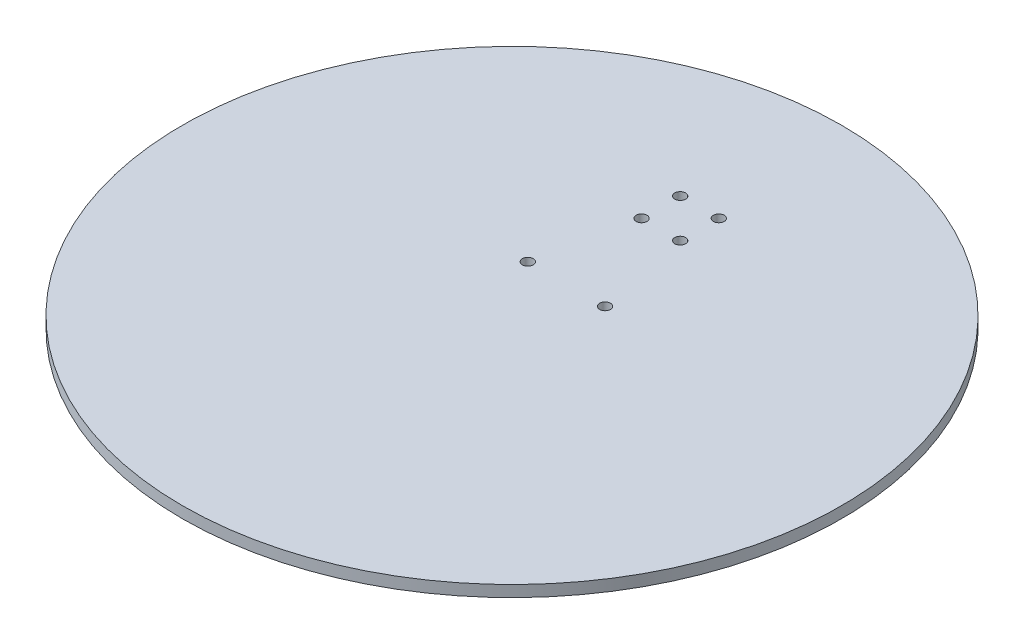
ISO-10303-21;
HEADER;
FILE_DESCRIPTION(('STEP AP214'),'2;1');
FILE_NAME('part.step','',(''),(''),'','','');
FILE_SCHEMA(('AUTOMOTIVE_DESIGN { 1 0 10303 214 1 1 1 1 }'));
ENDSEC;
DATA;
#1=APPLICATION_CONTEXT('core data for automotive mechanical design processes');
#2=APPLICATION_PROTOCOL_DEFINITION('international standard','automotive_design',2000,#1);
#3=PRODUCT_CONTEXT('',#1,'mechanical');
#4=PRODUCT('Part','Part','',(#3));
#5=PRODUCT_RELATED_PRODUCT_CATEGORY('part','',(#4));
#6=PRODUCT_DEFINITION_FORMATION('','',#4);
#7=PRODUCT_DEFINITION_CONTEXT('part definition',#1,'design');
#8=PRODUCT_DEFINITION('design','',#6,#7);
#9=PRODUCT_DEFINITION_SHAPE('','',#8);
#10=(LENGTH_UNIT() NAMED_UNIT(*) SI_UNIT(.MILLI.,.METRE.));
#11=(NAMED_UNIT(*) PLANE_ANGLE_UNIT() SI_UNIT($,.RADIAN.));
#12=(NAMED_UNIT(*) SI_UNIT($,.STERADIAN.) SOLID_ANGLE_UNIT());
#13=UNCERTAINTY_MEASURE_WITH_UNIT(LENGTH_MEASURE(1.E-05),#10,'distance_accuracy_value','');
#14=(GEOMETRIC_REPRESENTATION_CONTEXT(3) GLOBAL_UNCERTAINTY_ASSIGNED_CONTEXT((#13)) GLOBAL_UNIT_ASSIGNED_CONTEXT((#10,
#11,#12)) REPRESENTATION_CONTEXT('',''));
#15=CARTESIAN_POINT('',(0.,0.,0.));
#16=DIRECTION('',(0.,0.,1.));
#17=DIRECTION('',(1.,0.,0.));
#18=AXIS2_PLACEMENT_3D('',#15,#16,#17);
#19=CARTESIAN_POINT('',(0.,4.7,0.));
#20=DIRECTION('',(0.,1.,0.));
#21=DIRECTION('',(0.,0.,1.));
#22=AXIS2_PLACEMENT_3D('',#19,#20,#21);
#23=PLANE('',#22);
#24=CARTESIAN_POINT('',(-16.,4.7,-22.54));
#25=DIRECTION('',(0.,1.,0.));
#26=DIRECTION('',(0.,0.,1.));
#27=AXIS2_PLACEMENT_3D('',#24,#25,#26);
#28=CIRCLE('',#27,2.25);
#29=CARTESIAN_POINT('',(-16.,4.7,-20.29));
#30=VERTEX_POINT('',#29);
#31=EDGE_CURVE('E86',#30,#30,#28,.T.);
#32=ORIENTED_EDGE('',*,*,#31,.F.);
#33=EDGE_LOOP('',(#32));
#34=FACE_BOUND('',#33,.T.);
#35=CARTESIAN_POINT('',(7.99999999999999,4.7,-61.66));
#36=DIRECTION('',(0.,1.,0.));
#37=DIRECTION('',(0.,0.,1.));
#38=AXIS2_PLACEMENT_3D('',#35,#36,#37);
#39=CIRCLE('',#38,2.25);
#40=CARTESIAN_POINT('',(7.99999999999999,4.7,-59.41));
#41=VERTEX_POINT('',#40);
#42=EDGE_CURVE('E70',#41,#41,#39,.T.);
#43=ORIENTED_EDGE('',*,*,#42,.F.);
#44=EDGE_LOOP('',(#43));
#45=FACE_BOUND('',#44,.T.);
#46=CARTESIAN_POINT('',(-8.00000000000002,4.7,-77.66));
#47=DIRECTION('',(0.,1.,0.));
#48=DIRECTION('',(0.,0.,1.));
#49=AXIS2_PLACEMENT_3D('',#46,#47,#48);
#50=CIRCLE('',#49,2.25);
#51=CARTESIAN_POINT('',(-8.00000000000002,4.7,-75.41));
#52=VERTEX_POINT('',#51);
#53=EDGE_CURVE('E56',#52,#52,#50,.T.);
#54=ORIENTED_EDGE('',*,*,#53,.F.);
#55=EDGE_LOOP('',(#54));
#56=FACE_BOUND('',#55,.T.);
#57=CARTESIAN_POINT('',(0.,4.7,0.));
#58=DIRECTION('',(0.,1.,0.));
#59=DIRECTION('',(0.,0.,1.));
#60=AXIS2_PLACEMENT_3D('',#57,#58,#59);
#61=CIRCLE('',#60,136.5);
#62=CARTESIAN_POINT('',(0.,4.7,136.5));
#63=VERTEX_POINT('',#62);
#64=EDGE_CURVE('E10',#63,#63,#61,.T.);
#65=ORIENTED_EDGE('',*,*,#64,.T.);
#66=EDGE_LOOP('',(#65));
#67=FACE_BOUND('',#66,.T.);
#68=CARTESIAN_POINT('',(7.99999999999998,4.7,-77.66));
#69=DIRECTION('',(0.,1.,0.));
#70=DIRECTION('',(0.,0.,1.));
#71=AXIS2_PLACEMENT_3D('',#68,#69,#70);
#72=CIRCLE('',#71,2.25);
#73=CARTESIAN_POINT('',(7.99999999999998,4.7,-75.41));
#74=VERTEX_POINT('',#73);
#75=EDGE_CURVE('E62',#74,#74,#72,.T.);
#76=ORIENTED_EDGE('',*,*,#75,.F.);
#77=EDGE_LOOP('',(#76));
#78=FACE_BOUND('',#77,.T.);
#79=CARTESIAN_POINT('',(-8.00000000000002,4.7,-61.66));
#80=DIRECTION('',(0.,1.,0.));
#81=DIRECTION('',(0.,0.,1.));
#82=AXIS2_PLACEMENT_3D('',#79,#80,#81);
#83=CIRCLE('',#82,2.25);
#84=CARTESIAN_POINT('',(-8.00000000000002,4.7,-59.41));
#85=VERTEX_POINT('',#84);
#86=EDGE_CURVE('E78',#85,#85,#83,.T.);
#87=ORIENTED_EDGE('',*,*,#86,.F.);
#88=EDGE_LOOP('',(#87));
#89=FACE_BOUND('',#88,.T.);
#90=CARTESIAN_POINT('',(16.,4.7,-22.54));
#91=DIRECTION('',(0.,1.,0.));
#92=DIRECTION('',(0.,0.,1.));
#93=AXIS2_PLACEMENT_3D('',#90,#91,#92);
#94=CIRCLE('',#93,2.25);
#95=CARTESIAN_POINT('',(16.,4.7,-20.29));
#96=VERTEX_POINT('',#95);
#97=EDGE_CURVE('E94',#96,#96,#94,.T.);
#98=ORIENTED_EDGE('',*,*,#97,.F.);
#99=EDGE_LOOP('',(#98));
#100=FACE_BOUND('',#99,.T.);
#101=ADVANCED_FACE('F43',(#34,#45,#56,#67,#78,#89,#100),#23,.T.);
#102=CARTESIAN_POINT('',(0.,0.,0.));
#103=DIRECTION('',(0.,1.,0.));
#104=DIRECTION('',(0.,0.,1.));
#105=AXIS2_PLACEMENT_3D('',#102,#103,#104);
#106=PLANE('',#105);
#107=CARTESIAN_POINT('',(0.,0.,0.));
#108=DIRECTION('',(0.,1.,0.));
#109=DIRECTION('',(0.,0.,1.));
#110=AXIS2_PLACEMENT_3D('',#107,#108,#109);
#111=CIRCLE('',#110,136.5);
#112=CARTESIAN_POINT('',(0.,0.,136.5));
#113=VERTEX_POINT('',#112);
#114=EDGE_CURVE('E47',#113,#113,#111,.T.);
#115=ORIENTED_EDGE('',*,*,#114,.F.);
#116=EDGE_LOOP('',(#115));
#117=FACE_BOUND('',#116,.T.);
#118=CARTESIAN_POINT('',(-8.00000000000002,0.,-77.66));
#119=DIRECTION('',(0.,1.,0.));
#120=DIRECTION('',(0.,0.,1.));
#121=AXIS2_PLACEMENT_3D('',#118,#119,#120);
#122=CIRCLE('',#121,2.25);
#123=CARTESIAN_POINT('',(-8.00000000000002,0.,-75.41));
#124=VERTEX_POINT('',#123);
#125=EDGE_CURVE('E58',#124,#124,#122,.T.);
#126=ORIENTED_EDGE('',*,*,#125,.T.);
#127=EDGE_LOOP('',(#126));
#128=FACE_BOUND('',#127,.T.);
#129=CARTESIAN_POINT('',(7.99999999999998,0.,-77.66));
#130=DIRECTION('',(0.,1.,0.));
#131=DIRECTION('',(0.,0.,1.));
#132=AXIS2_PLACEMENT_3D('',#129,#130,#131);
#133=CIRCLE('',#132,2.25);
#134=CARTESIAN_POINT('',(7.99999999999998,0.,-75.41));
#135=VERTEX_POINT('',#134);
#136=EDGE_CURVE('E66',#135,#135,#133,.T.);
#137=ORIENTED_EDGE('',*,*,#136,.T.);
#138=EDGE_LOOP('',(#137));
#139=FACE_BOUND('',#138,.T.);
#140=CARTESIAN_POINT('',(7.99999999999999,0.,-61.66));
#141=DIRECTION('',(0.,1.,0.));
#142=DIRECTION('',(0.,0.,1.));
#143=AXIS2_PLACEMENT_3D('',#140,#141,#142);
#144=CIRCLE('',#143,2.25);
#145=CARTESIAN_POINT('',(7.99999999999999,0.,-59.41));
#146=VERTEX_POINT('',#145);
#147=EDGE_CURVE('E74',#146,#146,#144,.T.);
#148=ORIENTED_EDGE('',*,*,#147,.T.);
#149=EDGE_LOOP('',(#148));
#150=FACE_BOUND('',#149,.T.);
#151=CARTESIAN_POINT('',(-8.00000000000002,0.,-61.66));
#152=DIRECTION('',(0.,1.,0.));
#153=DIRECTION('',(0.,0.,1.));
#154=AXIS2_PLACEMENT_3D('',#151,#152,#153);
#155=CIRCLE('',#154,2.25);
#156=CARTESIAN_POINT('',(-8.00000000000002,0.,-59.41));
#157=VERTEX_POINT('',#156);
#158=EDGE_CURVE('E82',#157,#157,#155,.T.);
#159=ORIENTED_EDGE('',*,*,#158,.T.);
#160=EDGE_LOOP('',(#159));
#161=FACE_BOUND('',#160,.T.);
#162=CARTESIAN_POINT('',(-16.,0.,-22.54));
#163=DIRECTION('',(0.,1.,0.));
#164=DIRECTION('',(0.,0.,1.));
#165=AXIS2_PLACEMENT_3D('',#162,#163,#164);
#166=CIRCLE('',#165,2.25);
#167=CARTESIAN_POINT('',(-16.,0.,-20.29));
#168=VERTEX_POINT('',#167);
#169=EDGE_CURVE('E90',#168,#168,#166,.T.);
#170=ORIENTED_EDGE('',*,*,#169,.T.);
#171=EDGE_LOOP('',(#170));
#172=FACE_BOUND('',#171,.T.);
#173=CARTESIAN_POINT('',(16.,0.,-22.54));
#174=DIRECTION('',(0.,1.,0.));
#175=DIRECTION('',(0.,0.,1.));
#176=AXIS2_PLACEMENT_3D('',#173,#174,#175);
#177=CIRCLE('',#176,2.25);
#178=CARTESIAN_POINT('',(16.,0.,-20.29));
#179=VERTEX_POINT('',#178);
#180=EDGE_CURVE('E98',#179,#179,#177,.T.);
#181=ORIENTED_EDGE('',*,*,#180,.T.);
#182=EDGE_LOOP('',(#181));
#183=FACE_BOUND('',#182,.T.);
#184=ADVANCED_FACE('F110',(#117,#128,#139,#150,#161,#172,#183),#106,.F.);
#185=CARTESIAN_POINT('',(0.,4.7,0.));
#186=DIRECTION('',(0.,-1.,0.));
#187=DIRECTION('',(0.,0.,-1.));
#188=AXIS2_PLACEMENT_3D('',#185,#186,#187);
#189=CYLINDRICAL_SURFACE('',#188,136.5);
#190=ORIENTED_EDGE('',*,*,#64,.F.);
#191=EDGE_LOOP('',(#190));
#192=FACE_BOUND('',#191,.T.);
#193=ORIENTED_EDGE('',*,*,#114,.T.);
#194=EDGE_LOOP('',(#193));
#195=FACE_BOUND('',#194,.T.);
#196=ADVANCED_FACE('F45',(#192,#195),#189,.T.);
#197=CARTESIAN_POINT('',(-8.00000000000002,4.7,-77.66));
#198=DIRECTION('',(0.,-1.,0.));
#199=DIRECTION('',(0.,0.,-1.));
#200=AXIS2_PLACEMENT_3D('',#197,#198,#199);
#201=CYLINDRICAL_SURFACE('',#200,2.25);
#202=ORIENTED_EDGE('',*,*,#53,.T.);
#203=EDGE_LOOP('',(#202));
#204=FACE_BOUND('',#203,.T.);
#205=ORIENTED_EDGE('',*,*,#125,.F.);
#206=EDGE_LOOP('',(#205));
#207=FACE_BOUND('',#206,.T.);
#208=ADVANCED_FACE('F120',(#204,#207),#201,.F.);
#209=CARTESIAN_POINT('',(7.99999999999998,4.7,-77.66));
#210=DIRECTION('',(0.,-1.,0.));
#211=DIRECTION('',(0.,0.,-1.));
#212=AXIS2_PLACEMENT_3D('',#209,#210,#211);
#213=CYLINDRICAL_SURFACE('',#212,2.25);
#214=ORIENTED_EDGE('',*,*,#75,.T.);
#215=EDGE_LOOP('',(#214));
#216=FACE_BOUND('',#215,.T.);
#217=ORIENTED_EDGE('',*,*,#136,.F.);
#218=EDGE_LOOP('',(#217));
#219=FACE_BOUND('',#218,.T.);
#220=ADVANCED_FACE('F123',(#216,#219),#213,.F.);
#221=CARTESIAN_POINT('',(7.99999999999999,4.7,-61.66));
#222=DIRECTION('',(0.,-1.,0.));
#223=DIRECTION('',(0.,0.,-1.));
#224=AXIS2_PLACEMENT_3D('',#221,#222,#223);
#225=CYLINDRICAL_SURFACE('',#224,2.25);
#226=ORIENTED_EDGE('',*,*,#42,.T.);
#227=EDGE_LOOP('',(#226));
#228=FACE_BOUND('',#227,.T.);
#229=ORIENTED_EDGE('',*,*,#147,.F.);
#230=EDGE_LOOP('',(#229));
#231=FACE_BOUND('',#230,.T.);
#232=ADVANCED_FACE('F127',(#228,#231),#225,.F.);
#233=CARTESIAN_POINT('',(-8.00000000000002,4.7,-61.66));
#234=DIRECTION('',(0.,-1.,0.));
#235=DIRECTION('',(0.,0.,-1.));
#236=AXIS2_PLACEMENT_3D('',#233,#234,#235);
#237=CYLINDRICAL_SURFACE('',#236,2.25);
#238=ORIENTED_EDGE('',*,*,#86,.T.);
#239=EDGE_LOOP('',(#238));
#240=FACE_BOUND('',#239,.T.);
#241=ORIENTED_EDGE('',*,*,#158,.F.);
#242=EDGE_LOOP('',(#241));
#243=FACE_BOUND('',#242,.T.);
#244=ADVANCED_FACE('F131',(#240,#243),#237,.F.);
#245=CARTESIAN_POINT('',(-16.,4.7,-22.54));
#246=DIRECTION('',(0.,-1.,0.));
#247=DIRECTION('',(0.,0.,-1.));
#248=AXIS2_PLACEMENT_3D('',#245,#246,#247);
#249=CYLINDRICAL_SURFACE('',#248,2.25);
#250=ORIENTED_EDGE('',*,*,#31,.T.);
#251=EDGE_LOOP('',(#250));
#252=FACE_BOUND('',#251,.T.);
#253=ORIENTED_EDGE('',*,*,#169,.F.);
#254=EDGE_LOOP('',(#253));
#255=FACE_BOUND('',#254,.T.);
#256=ADVANCED_FACE('F135',(#252,#255),#249,.F.);
#257=CARTESIAN_POINT('',(16.,4.7,-22.54));
#258=DIRECTION('',(0.,-1.,0.));
#259=DIRECTION('',(0.,0.,-1.));
#260=AXIS2_PLACEMENT_3D('',#257,#258,#259);
#261=CYLINDRICAL_SURFACE('',#260,2.25);
#262=ORIENTED_EDGE('',*,*,#97,.T.);
#263=EDGE_LOOP('',(#262));
#264=FACE_BOUND('',#263,.T.);
#265=ORIENTED_EDGE('',*,*,#180,.F.);
#266=EDGE_LOOP('',(#265));
#267=FACE_BOUND('',#266,.T.);
#268=ADVANCED_FACE('F106',(#264,#267),#261,.F.);
#269=CLOSED_SHELL('',(#101,#184,#196,#208,#220,#232,#244,#256,#268));
#270=MANIFOLD_SOLID_BREP('B2',#269);
#271=ADVANCED_BREP_SHAPE_REPRESENTATION('',(#18,#270),#14);
#272=SHAPE_DEFINITION_REPRESENTATION(#9,#271);
ENDSEC;
END-ISO-10303-21;
